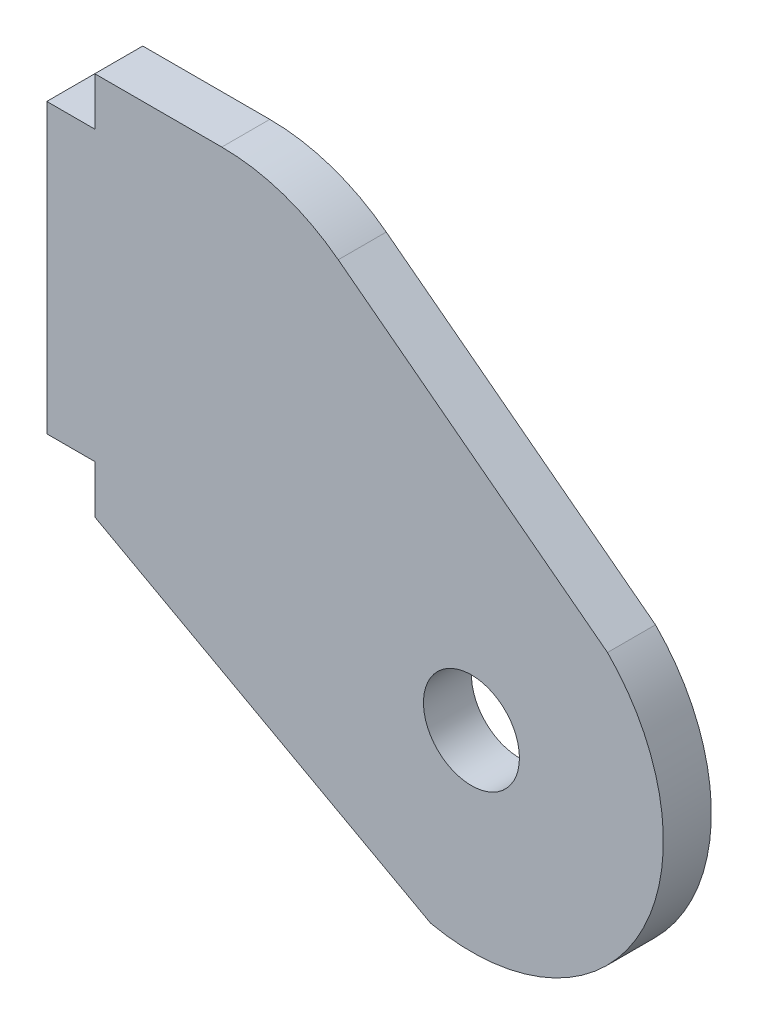
ISO-10303-21;
HEADER;
FILE_DESCRIPTION(('STEP AP214'),'2;1');
FILE_NAME('part.step','',(''),(''),'','','');
FILE_SCHEMA(('AUTOMOTIVE_DESIGN { 1 0 10303 214 1 1 1 1 }'));
ENDSEC;
DATA;
#1=APPLICATION_CONTEXT('core data for automotive mechanical design processes');
#2=APPLICATION_PROTOCOL_DEFINITION('international standard','automotive_design',2000,#1);
#3=PRODUCT_CONTEXT('',#1,'mechanical');
#4=PRODUCT('Part','Part','',(#3));
#5=PRODUCT_RELATED_PRODUCT_CATEGORY('part','',(#4));
#6=PRODUCT_DEFINITION_FORMATION('','',#4);
#7=PRODUCT_DEFINITION_CONTEXT('part definition',#1,'design');
#8=PRODUCT_DEFINITION('design','',#6,#7);
#9=PRODUCT_DEFINITION_SHAPE('','',#8);
#10=(LENGTH_UNIT() NAMED_UNIT(*) SI_UNIT(.MILLI.,.METRE.));
#11=(NAMED_UNIT(*) PLANE_ANGLE_UNIT() SI_UNIT($,.RADIAN.));
#12=(NAMED_UNIT(*) SI_UNIT($,.STERADIAN.) SOLID_ANGLE_UNIT());
#13=UNCERTAINTY_MEASURE_WITH_UNIT(LENGTH_MEASURE(1.E-05),#10,'distance_accuracy_value','');
#14=(GEOMETRIC_REPRESENTATION_CONTEXT(3) GLOBAL_UNCERTAINTY_ASSIGNED_CONTEXT((#13)) GLOBAL_UNIT_ASSIGNED_CONTEXT((#10,
#11,#12)) REPRESENTATION_CONTEXT('',''));
#15=CARTESIAN_POINT('',(0.,0.,0.));
#16=DIRECTION('',(0.,0.,1.));
#17=DIRECTION('',(1.,0.,0.));
#18=AXIS2_PLACEMENT_3D('',#15,#16,#17);
#19=CARTESIAN_POINT('',(427.91942335712,0.,-3.175));
#20=DIRECTION('',(1.,0.,0.));
#21=DIRECTION('',(0.,0.,1.));
#22=AXIS2_PLACEMENT_3D('',#19,#20,#21);
#23=PLANE('',#22);
#24=DIRECTION('',(0.,-1.,0.));
#25=VECTOR('',#24,1.);
#26=CARTESIAN_POINT('',(427.91942335712,0.,0.));
#27=LINE('',#26,#25);
#28=CARTESIAN_POINT('',(427.91942335712,0.,0.));
#29=VERTEX_POINT('',#28);
#30=CARTESIAN_POINT('',(427.91942335712,-3.17499999999997,0.));
#31=VERTEX_POINT('',#30);
#32=EDGE_CURVE('E162',#29,#31,#27,.T.);
#33=ORIENTED_EDGE('',*,*,#32,.F.);
#34=DIRECTION('',(0.,0.,1.));
#35=VECTOR('',#34,1.);
#36=CARTESIAN_POINT('',(427.91942335712,0.,-3.175));
#37=LINE('',#36,#35);
#38=CARTESIAN_POINT('',(427.91942335712,0.,-3.175));
#39=VERTEX_POINT('',#38);
#40=EDGE_CURVE('E135',#39,#29,#37,.T.);
#41=ORIENTED_EDGE('',*,*,#40,.F.);
#42=DIRECTION('',(0.,-1.,0.));
#43=VECTOR('',#42,1.);
#44=CARTESIAN_POINT('',(427.91942335712,0.,-3.175));
#45=LINE('',#44,#43);
#46=CARTESIAN_POINT('',(427.91942335712,-3.17499999999997,-3.175));
#47=VERTEX_POINT('',#46);
#48=EDGE_CURVE('E115',#39,#47,#45,.T.);
#49=ORIENTED_EDGE('',*,*,#48,.T.);
#50=DIRECTION('',(0.,0.,1.));
#51=VECTOR('',#50,1.);
#52=CARTESIAN_POINT('',(427.91942335712,-3.17499999999997,-3.175));
#53=LINE('',#52,#51);
#54=EDGE_CURVE('E124',#47,#31,#53,.T.);
#55=ORIENTED_EDGE('',*,*,#54,.T.);
#56=EDGE_LOOP('',(#33,#41,#49,#55));
#57=FACE_BOUND('',#56,.T.);
#58=ADVANCED_FACE('F37',(#57),#23,.F.);
#59=CARTESIAN_POINT('',(424.74442335712,-3.17499999999998,-3.175));
#60=DIRECTION('',(0.,-1.,0.));
#61=DIRECTION('',(1.,0.,0.));
#62=AXIS2_PLACEMENT_3D('',#59,#60,#61);
#63=PLANE('',#62);
#64=DIRECTION('',(-1.,0.,0.));
#65=VECTOR('',#64,1.);
#66=CARTESIAN_POINT('',(424.74442335712,-3.17499999999998,0.));
#67=LINE('',#66,#65);
#68=CARTESIAN_POINT('',(424.74442335712,-3.17499999999998,0.));
#69=VERTEX_POINT('',#68);
#70=EDGE_CURVE('E127',#31,#69,#67,.T.);
#71=ORIENTED_EDGE('',*,*,#70,.F.);
#72=ORIENTED_EDGE('',*,*,#54,.F.);
#73=DIRECTION('',(-1.,0.,0.));
#74=VECTOR('',#73,1.);
#75=CARTESIAN_POINT('',(424.74442335712,-3.17499999999998,-3.175));
#76=LINE('',#75,#74);
#77=CARTESIAN_POINT('',(424.74442335712,-3.17499999999998,-3.175));
#78=VERTEX_POINT('',#77);
#79=EDGE_CURVE('E111',#47,#78,#76,.T.);
#80=ORIENTED_EDGE('',*,*,#79,.T.);
#81=DIRECTION('',(0.,0.,1.));
#82=VECTOR('',#81,1.);
#83=CARTESIAN_POINT('',(424.74442335712,-3.17499999999998,-3.175));
#84=LINE('',#83,#82);
#85=EDGE_CURVE('E132',#78,#69,#84,.T.);
#86=ORIENTED_EDGE('',*,*,#85,.T.);
#87=EDGE_LOOP('',(#71,#72,#80,#86));
#88=FACE_BOUND('',#87,.T.);
#89=ADVANCED_FACE('F125',(#88),#63,.F.);
#90=CARTESIAN_POINT('',(424.74442335712,-22.225,-3.175));
#91=DIRECTION('',(1.,0.,0.));
#92=DIRECTION('',(0.,0.,1.));
#93=AXIS2_PLACEMENT_3D('',#90,#91,#92);
#94=PLANE('',#93);
#95=DIRECTION('',(0.,-1.,0.));
#96=VECTOR('',#95,1.);
#97=CARTESIAN_POINT('',(424.74442335712,-22.225,0.));
#98=LINE('',#97,#96);
#99=CARTESIAN_POINT('',(424.74442335712,-22.225,0.));
#100=VERTEX_POINT('',#99);
#101=EDGE_CURVE('E165',#69,#100,#98,.T.);
#102=ORIENTED_EDGE('',*,*,#101,.F.);
#103=ORIENTED_EDGE('',*,*,#85,.F.);
#104=DIRECTION('',(0.,-1.,0.));
#105=VECTOR('',#104,1.);
#106=CARTESIAN_POINT('',(424.74442335712,-22.225,-3.175));
#107=LINE('',#106,#105);
#108=CARTESIAN_POINT('',(424.74442335712,-22.225,-3.175));
#109=VERTEX_POINT('',#108);
#110=EDGE_CURVE('E118',#78,#109,#107,.T.);
#111=ORIENTED_EDGE('',*,*,#110,.T.);
#112=DIRECTION('',(0.,0.,1.));
#113=VECTOR('',#112,1.);
#114=CARTESIAN_POINT('',(424.74442335712,-22.225,-3.175));
#115=LINE('',#114,#113);
#116=EDGE_CURVE('E195',#109,#100,#115,.T.);
#117=ORIENTED_EDGE('',*,*,#116,.T.);
#118=EDGE_LOOP('',(#102,#103,#111,#117));
#119=FACE_BOUND('',#118,.T.);
#120=ADVANCED_FACE('F217',(#119),#94,.F.);
#121=CARTESIAN_POINT('',(427.91942335712,-22.225,-3.175));
#122=DIRECTION('',(0.,1.,0.));
#123=DIRECTION('',(-1.,0.,0.));
#124=AXIS2_PLACEMENT_3D('',#121,#122,#123);
#125=PLANE('',#124);
#126=DIRECTION('',(1.,0.,0.));
#127=VECTOR('',#126,1.);
#128=CARTESIAN_POINT('',(427.91942335712,-22.225,0.));
#129=LINE('',#128,#127);
#130=CARTESIAN_POINT('',(427.91942335712,-22.225,0.));
#131=VERTEX_POINT('',#130);
#132=EDGE_CURVE('E168',#100,#131,#129,.T.);
#133=ORIENTED_EDGE('',*,*,#132,.F.);
#134=ORIENTED_EDGE('',*,*,#116,.F.);
#135=DIRECTION('',(1.,0.,0.));
#136=VECTOR('',#135,1.);
#137=CARTESIAN_POINT('',(427.91942335712,-22.225,-3.175));
#138=LINE('',#137,#136);
#139=CARTESIAN_POINT('',(427.91942335712,-22.225,-3.175));
#140=VERTEX_POINT('',#139);
#141=EDGE_CURVE('E145',#109,#140,#138,.T.);
#142=ORIENTED_EDGE('',*,*,#141,.T.);
#143=DIRECTION('',(0.,0.,1.));
#144=VECTOR('',#143,1.);
#145=CARTESIAN_POINT('',(427.91942335712,-22.225,-3.175));
#146=LINE('',#145,#144);
#147=EDGE_CURVE('E192',#140,#131,#146,.T.);
#148=ORIENTED_EDGE('',*,*,#147,.T.);
#149=EDGE_LOOP('',(#133,#134,#142,#148));
#150=FACE_BOUND('',#149,.T.);
#151=ADVANCED_FACE('F215',(#150),#125,.F.);
#152=CARTESIAN_POINT('',(427.91942335712,-22.225,-3.175));
#153=DIRECTION('',(1.,0.,0.));
#154=DIRECTION('',(0.,0.,1.));
#155=AXIS2_PLACEMENT_3D('',#152,#153,#154);
#156=PLANE('',#155);
#157=DIRECTION('',(0.,-1.,0.));
#158=VECTOR('',#157,1.);
#159=CARTESIAN_POINT('',(427.91942335712,-22.225,0.));
#160=LINE('',#159,#158);
#161=CARTESIAN_POINT('',(427.91942335712,-25.3999999999999,0.));
#162=VERTEX_POINT('',#161);
#163=EDGE_CURVE('E171',#131,#162,#160,.T.);
#164=ORIENTED_EDGE('',*,*,#163,.F.);
#165=ORIENTED_EDGE('',*,*,#147,.F.);
#166=DIRECTION('',(0.,-1.,0.));
#167=VECTOR('',#166,1.);
#168=CARTESIAN_POINT('',(427.91942335712,-22.225,-3.175));
#169=LINE('',#168,#167);
#170=CARTESIAN_POINT('',(427.91942335712,-25.3999999999999,-3.175));
#171=VERTEX_POINT('',#170);
#172=EDGE_CURVE('E148',#140,#171,#169,.T.);
#173=ORIENTED_EDGE('',*,*,#172,.T.);
#174=DIRECTION('',(0.,0.,1.));
#175=VECTOR('',#174,1.);
#176=CARTESIAN_POINT('',(427.91942335712,-25.3999999999999,-3.175));
#177=LINE('',#176,#175);
#178=EDGE_CURVE('E189',#171,#162,#177,.T.);
#179=ORIENTED_EDGE('',*,*,#178,.T.);
#180=EDGE_LOOP('',(#164,#165,#173,#179));
#181=FACE_BOUND('',#180,.T.);
#182=ADVANCED_FACE('F212',(#181),#156,.F.);
#183=CARTESIAN_POINT('',(427.91942335712,-25.3999999999999,-3.175));
#184=DIRECTION('',(0.480325676751226,0.87709021443263,0.));
#185=DIRECTION('',(-0.87709021443263,0.480325676751226,0.));
#186=AXIS2_PLACEMENT_3D('',#183,#184,#185);
#187=PLANE('',#186);
#188=DIRECTION('',(0.87709021443263,-0.480325676751225,0.));
#189=VECTOR('',#188,1.);
#190=CARTESIAN_POINT('',(427.91942335712,-25.3999999999999,0.));
#191=LINE('',#190,#189);
#192=CARTESIAN_POINT('',(450.14442335712,-37.5711974322978,0.));
#193=VERTEX_POINT('',#192);
#194=EDGE_CURVE('E174',#162,#193,#191,.T.);
#195=ORIENTED_EDGE('',*,*,#194,.F.);
#196=ORIENTED_EDGE('',*,*,#178,.F.);
#197=DIRECTION('',(0.87709021443263,-0.480325676751225,0.));
#198=VECTOR('',#197,1.);
#199=CARTESIAN_POINT('',(427.91942335712,-25.3999999999999,-3.175));
#200=LINE('',#199,#198);
#201=CARTESIAN_POINT('',(450.14442335712,-37.5711974322978,-3.175));
#202=VERTEX_POINT('',#201);
#203=EDGE_CURVE('E151',#171,#202,#200,.T.);
#204=ORIENTED_EDGE('',*,*,#203,.T.);
#205=DIRECTION('',(0.,0.,1.));
#206=VECTOR('',#205,1.);
#207=CARTESIAN_POINT('',(450.14442335712,-37.5711974322978,-3.175));
#208=LINE('',#207,#206);
#209=EDGE_CURVE('E186',#202,#193,#208,.T.);
#210=ORIENTED_EDGE('',*,*,#209,.T.);
#211=EDGE_LOOP('',(#195,#196,#204,#210));
#212=FACE_BOUND('',#211,.T.);
#213=ADVANCED_FACE('F209',(#212),#187,.F.);
#214=CARTESIAN_POINT('',(452.84317335712,-25.1612518869902,-3.175));
#215=DIRECTION('',(0.,0.,1.));
#216=DIRECTION('',(-1.,0.,0.));
#217=AXIS2_PLACEMENT_3D('',#214,#215,#216);
#218=CYLINDRICAL_SURFACE('',#217,12.7);
#219=CARTESIAN_POINT('',(452.84317335712,-25.1612518869902,0.));
#220=DIRECTION('',(0.,0.,1.));
#221=DIRECTION('',(1.,0.,0.));
#222=AXIS2_PLACEMENT_3D('',#219,#220,#221);
#223=CIRCLE('',#222,12.7);
#224=CARTESIAN_POINT('',(461.846041333275,-16.2036647004802,0.));
#225=VERTEX_POINT('',#224);
#226=EDGE_CURVE('E177',#193,#225,#223,.T.);
#227=ORIENTED_EDGE('',*,*,#226,.F.);
#228=ORIENTED_EDGE('',*,*,#209,.F.);
#229=CARTESIAN_POINT('',(452.84317335712,-25.1612518869902,-3.175));
#230=DIRECTION('',(0.,0.,1.));
#231=DIRECTION('',(1.,0.,0.));
#232=AXIS2_PLACEMENT_3D('',#229,#230,#231);
#233=CIRCLE('',#232,12.7);
#234=CARTESIAN_POINT('',(461.846041333275,-16.2036647004802,-3.175));
#235=VERTEX_POINT('',#234);
#236=EDGE_CURVE('E154',#202,#235,#233,.T.);
#237=ORIENTED_EDGE('',*,*,#236,.T.);
#238=DIRECTION('',(0.,0.,1.));
#239=VECTOR('',#238,1.);
#240=CARTESIAN_POINT('',(461.846041333275,-16.2036647004802,-3.175));
#241=LINE('',#240,#239);
#242=EDGE_CURVE('E183',#235,#225,#241,.T.);
#243=ORIENTED_EDGE('',*,*,#242,.T.);
#244=EDGE_LOOP('',(#227,#228,#237,#243));
#245=FACE_BOUND('',#244,.T.);
#246=ADVANCED_FACE('F207',(#245),#218,.T.);
#247=CARTESIAN_POINT('',(440.61942335712,0.,-3.175));
#248=DIRECTION('',(-0.606777523421596,-0.794871711076923,0.));
#249=DIRECTION('',(0.794871711076923,-0.606777523421596,0.));
#250=AXIS2_PLACEMENT_3D('',#247,#248,#249);
#251=PLANE('',#250);
#252=DIRECTION('',(-0.794871711076923,0.606777523421596,0.));
#253=VECTOR('',#252,1.);
#254=CARTESIAN_POINT('',(440.61942335712,0.,0.));
#255=LINE('',#254,#253);
#256=CARTESIAN_POINT('',(444.03211331341,-2.60512926932308,0.));
#257=VERTEX_POINT('',#256);
#258=EDGE_CURVE('E138',#225,#257,#255,.T.);
#259=ORIENTED_EDGE('',*,*,#258,.F.);
#260=ORIENTED_EDGE('',*,*,#242,.F.);
#261=DIRECTION('',(-0.794871711076923,0.606777523421596,0.));
#262=VECTOR('',#261,1.);
#263=CARTESIAN_POINT('',(440.61942335712,0.,-3.175));
#264=LINE('',#263,#262);
#265=CARTESIAN_POINT('',(444.03211331341,-2.60512926932308,-3.175));
#266=VERTEX_POINT('',#265);
#267=EDGE_CURVE('E157',#235,#266,#264,.T.);
#268=ORIENTED_EDGE('',*,*,#267,.T.);
#269=DIRECTION('',(0.,0.,1.));
#270=VECTOR('',#269,1.);
#271=CARTESIAN_POINT('',(444.03211331341,-2.60512926932308,-3.175));
#272=LINE('',#271,#270);
#273=EDGE_CURVE('E45',#257,#266,#272,.F.);
#274=ORIENTED_EDGE('',*,*,#273,.F.);
#275=EDGE_LOOP('',(#259,#260,#268,#274));
#276=FACE_BOUND('',#275,.T.);
#277=ADVANCED_FACE('F203',(#276),#251,.F.);
#278=CARTESIAN_POINT('',(427.91942335712,0.,-3.175));
#279=DIRECTION('',(0.,-1.,0.));
#280=DIRECTION('',(0.,0.,1.));
#281=AXIS2_PLACEMENT_3D('',#278,#279,#280);
#282=PLANE('',#281);
#283=DIRECTION('',(-1.,0.,0.));
#284=VECTOR('',#283,1.);
#285=CARTESIAN_POINT('',(427.91942335712,0.,-3.175));
#286=LINE('',#285,#284);
#287=CARTESIAN_POINT('',(436.326038765956,0.,-3.175));
#288=VERTEX_POINT('',#287);
#289=EDGE_CURVE('E160',#288,#39,#286,.T.);
#290=ORIENTED_EDGE('',*,*,#289,.T.);
#291=ORIENTED_EDGE('',*,*,#40,.T.);
#292=DIRECTION('',(-1.,0.,0.));
#293=VECTOR('',#292,1.);
#294=CARTESIAN_POINT('',(427.91942335712,0.,0.));
#295=LINE('',#294,#293);
#296=CARTESIAN_POINT('',(436.326038765956,0.,0.));
#297=VERTEX_POINT('',#296);
#298=EDGE_CURVE('E136',#297,#29,#295,.T.);
#299=ORIENTED_EDGE('',*,*,#298,.F.);
#300=DIRECTION('',(0.,0.,1.));
#301=VECTOR('',#300,1.);
#302=CARTESIAN_POINT('',(436.326038765956,0.,-3.175));
#303=LINE('',#302,#301);
#304=EDGE_CURVE('E131',#288,#297,#303,.T.);
#305=ORIENTED_EDGE('',*,*,#304,.F.);
#306=EDGE_LOOP('',(#290,#291,#299,#305));
#307=FACE_BOUND('',#306,.T.);
#308=ADVANCED_FACE('F222',(#307),#282,.F.);
#309=CARTESIAN_POINT('',(452.84317335712,-25.1612518869902,-3.175));
#310=DIRECTION('',(0.,0.,-1.));
#311=DIRECTION('',(1.,0.,0.));
#312=AXIS2_PLACEMENT_3D('',#309,#310,#311);
#313=PLANE('',#312);
#314=CARTESIAN_POINT('',(452.84317335712,-25.1612518869902,-3.175));
#315=DIRECTION('',(0.,0.,1.));
#316=DIRECTION('',(1.,0.,0.));
#317=AXIS2_PLACEMENT_3D('',#314,#315,#316);
#318=CIRCLE('',#317,3.17499999999998);
#319=CARTESIAN_POINT('',(456.01817335712,-25.1612518869902,-3.175));
#320=VERTEX_POINT('',#319);
#321=EDGE_CURVE('E298',#320,#320,#318,.T.);
#322=ORIENTED_EDGE('',*,*,#321,.T.);
#323=EDGE_LOOP('',(#322));
#324=FACE_BOUND('',#323,.T.);
#325=ORIENTED_EDGE('',*,*,#267,.F.);
#326=ORIENTED_EDGE('',*,*,#236,.F.);
#327=ORIENTED_EDGE('',*,*,#203,.F.);
#328=ORIENTED_EDGE('',*,*,#172,.F.);
#329=ORIENTED_EDGE('',*,*,#141,.F.);
#330=ORIENTED_EDGE('',*,*,#110,.F.);
#331=ORIENTED_EDGE('',*,*,#79,.F.);
#332=ORIENTED_EDGE('',*,*,#48,.F.);
#333=ORIENTED_EDGE('',*,*,#289,.F.);
#334=CARTESIAN_POINT('',(436.326038765956,-12.7,-3.175));
#335=DIRECTION('',(0.,0.,1.));
#336=DIRECTION('',(1.,0.,0.));
#337=AXIS2_PLACEMENT_3D('',#334,#335,#336);
#338=CIRCLE('',#337,12.7);
#339=EDGE_CURVE('E11',#266,#288,#338,.T.);
#340=ORIENTED_EDGE('',*,*,#339,.F.);
#341=EDGE_LOOP('',(#325,#326,#327,#328,#329,#330,#331,#332,#333,#340));
#342=FACE_BOUND('',#341,.T.);
#343=ADVANCED_FACE('F113',(#324,#342),#313,.T.);
#344=CARTESIAN_POINT('',(452.84317335712,-25.1612518869902,0.));
#345=DIRECTION('',(0.,0.,-1.));
#346=DIRECTION('',(1.,0.,0.));
#347=AXIS2_PLACEMENT_3D('',#344,#345,#346);
#348=PLANE('',#347);
#349=CARTESIAN_POINT('',(452.84317335712,-25.1612518869902,0.));
#350=DIRECTION('',(0.,0.,1.));
#351=DIRECTION('',(1.,0.,0.));
#352=AXIS2_PLACEMENT_3D('',#349,#350,#351);
#353=CIRCLE('',#352,3.17499999999998);
#354=CARTESIAN_POINT('',(456.01817335712,-25.1612518869902,0.));
#355=VERTEX_POINT('',#354);
#356=EDGE_CURVE('E141',#355,#355,#353,.T.);
#357=ORIENTED_EDGE('',*,*,#356,.F.);
#358=EDGE_LOOP('',(#357));
#359=FACE_BOUND('',#358,.T.);
#360=ORIENTED_EDGE('',*,*,#298,.T.);
#361=ORIENTED_EDGE('',*,*,#32,.T.);
#362=ORIENTED_EDGE('',*,*,#70,.T.);
#363=ORIENTED_EDGE('',*,*,#101,.T.);
#364=ORIENTED_EDGE('',*,*,#132,.T.);
#365=ORIENTED_EDGE('',*,*,#163,.T.);
#366=ORIENTED_EDGE('',*,*,#194,.T.);
#367=ORIENTED_EDGE('',*,*,#226,.T.);
#368=ORIENTED_EDGE('',*,*,#258,.T.);
#369=CARTESIAN_POINT('',(436.326038765956,-12.7,0.));
#370=DIRECTION('',(0.,0.,1.));
#371=DIRECTION('',(1.,0.,0.));
#372=AXIS2_PLACEMENT_3D('',#369,#370,#371);
#373=CIRCLE('',#372,12.7);
#374=EDGE_CURVE('E57',#297,#257,#373,.F.);
#375=ORIENTED_EDGE('',*,*,#374,.F.);
#376=EDGE_LOOP('',(#360,#361,#362,#363,#364,#365,#366,#367,#368,#375));
#377=FACE_BOUND('',#376,.T.);
#378=ADVANCED_FACE('F219',(#359,#377),#348,.F.);
#379=CARTESIAN_POINT('',(452.84317335712,-25.1612518869902,-3.175));
#380=DIRECTION('',(0.,0.,-1.));
#381=DIRECTION('',(1.,0.,0.));
#382=AXIS2_PLACEMENT_3D('',#379,#380,#381);
#383=CYLINDRICAL_SURFACE('',#382,3.17499999999998);
#384=ORIENTED_EDGE('',*,*,#321,.F.);
#385=EDGE_LOOP('',(#384));
#386=FACE_BOUND('',#385,.T.);
#387=ORIENTED_EDGE('',*,*,#356,.T.);
#388=EDGE_LOOP('',(#387));
#389=FACE_BOUND('',#388,.T.);
#390=ADVANCED_FACE('F275',(#386,#389),#383,.F.);
#391=CARTESIAN_POINT('',(436.326038765956,-12.7,-3.175));
#392=DIRECTION('',(0.,0.,1.));
#393=DIRECTION('',(-1.,0.,0.));
#394=AXIS2_PLACEMENT_3D('',#391,#392,#393);
#395=CYLINDRICAL_SURFACE('',#394,12.7);
#396=ORIENTED_EDGE('',*,*,#339,.T.);
#397=ORIENTED_EDGE('',*,*,#304,.T.);
#398=ORIENTED_EDGE('',*,*,#374,.T.);
#399=ORIENTED_EDGE('',*,*,#273,.T.);
#400=EDGE_LOOP('',(#396,#397,#398,#399));
#401=FACE_BOUND('',#400,.T.);
#402=ADVANCED_FACE('F39',(#401),#395,.T.);
#403=CLOSED_SHELL('',(#58,#89,#120,#151,#182,#213,#246,#277,#308,#343,#378,#390,#402));
#404=MANIFOLD_SOLID_BREP('B2',#403);
#405=ADVANCED_BREP_SHAPE_REPRESENTATION('',(#18,#404),#14);
#406=SHAPE_DEFINITION_REPRESENTATION(#9,#405);
ENDSEC;
END-ISO-10303-21;
